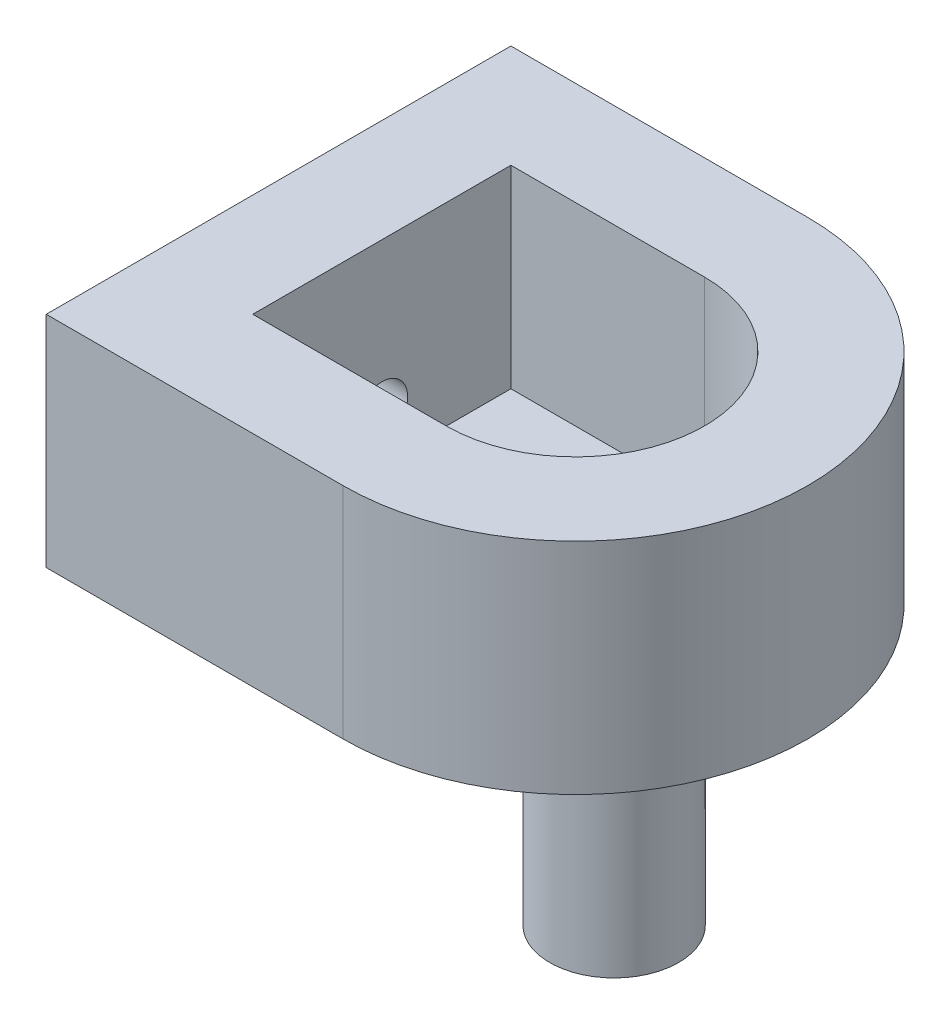
ISO-10303-21;
HEADER;
FILE_DESCRIPTION(('STEP AP214'),'2;1');
FILE_NAME('part.step','',(''),(''),'','','');
FILE_SCHEMA(('AUTOMOTIVE_DESIGN { 1 0 10303 214 1 1 1 1 }'));
ENDSEC;
DATA;
#1=APPLICATION_CONTEXT('core data for automotive mechanical design processes');
#2=APPLICATION_PROTOCOL_DEFINITION('international standard','automotive_design',2000,#1);
#3=PRODUCT_CONTEXT('',#1,'mechanical');
#4=PRODUCT('Part','Part','',(#3));
#5=PRODUCT_RELATED_PRODUCT_CATEGORY('part','',(#4));
#6=PRODUCT_DEFINITION_FORMATION('','',#4);
#7=PRODUCT_DEFINITION_CONTEXT('part definition',#1,'design');
#8=PRODUCT_DEFINITION('design','',#6,#7);
#9=PRODUCT_DEFINITION_SHAPE('','',#8);
#10=(LENGTH_UNIT() NAMED_UNIT(*) SI_UNIT(.MILLI.,.METRE.));
#11=(NAMED_UNIT(*) PLANE_ANGLE_UNIT() SI_UNIT($,.RADIAN.));
#12=(NAMED_UNIT(*) SI_UNIT($,.STERADIAN.) SOLID_ANGLE_UNIT());
#13=UNCERTAINTY_MEASURE_WITH_UNIT(LENGTH_MEASURE(1.E-05),#10,'distance_accuracy_value','');
#14=(GEOMETRIC_REPRESENTATION_CONTEXT(3) GLOBAL_UNCERTAINTY_ASSIGNED_CONTEXT((#13)) GLOBAL_UNIT_ASSIGNED_CONTEXT((#10,
#11,#12)) REPRESENTATION_CONTEXT('',''));
#15=CARTESIAN_POINT('',(0.,0.,0.));
#16=DIRECTION('',(0.,0.,1.));
#17=DIRECTION('',(1.,0.,0.));
#18=AXIS2_PLACEMENT_3D('',#15,#16,#17);
#19=CARTESIAN_POINT('',(0.,-2.,0.));
#20=DIRECTION('',(0.,-1.,0.));
#21=DIRECTION('',(0.,0.,-1.));
#22=AXIS2_PLACEMENT_3D('',#19,#20,#21);
#23=PLANE('',#22);
#24=CARTESIAN_POINT('',(3.,-2.,0.));
#25=DIRECTION('',(0.,-1.,0.));
#26=DIRECTION('',(0.,0.,-1.));
#27=AXIS2_PLACEMENT_3D('',#24,#25,#26);
#28=CIRCLE('',#27,3.);
#29=CARTESIAN_POINT('',(3.,-2.,-3.00000000000001));
#30=VERTEX_POINT('',#29);
#31=EDGE_CURVE('E49',#30,#30,#28,.F.);
#32=ORIENTED_EDGE('',*,*,#31,.T.);
#33=EDGE_LOOP('',(#32));
#34=FACE_BOUND('',#33,.T.);
#35=DIRECTION('',(1.,0.,0.));
#36=VECTOR('',#35,1.);
#37=CARTESIAN_POINT('',(-23.,-2.,-18.));
#38=LINE('',#37,#36);
#39=CARTESIAN_POINT('',(-23.,-2.,-18.));
#40=VERTEX_POINT('',#39);
#41=CARTESIAN_POINT('',(0.,-2.,-18.));
#42=VERTEX_POINT('',#41);
#43=EDGE_CURVE('E154',#40,#42,#38,.T.);
#44=ORIENTED_EDGE('',*,*,#43,.T.);
#45=CARTESIAN_POINT('',(0.,-2.,0.));
#46=DIRECTION('',(0.,-1.,0.));
#47=DIRECTION('',(0.,0.,-1.));
#48=AXIS2_PLACEMENT_3D('',#45,#46,#47);
#49=CIRCLE('',#48,18.);
#50=CARTESIAN_POINT('',(0.,-2.,18.));
#51=VERTEX_POINT('',#50);
#52=EDGE_CURVE('E152',#42,#51,#49,.T.);
#53=ORIENTED_EDGE('',*,*,#52,.T.);
#54=DIRECTION('',(1.,0.,0.));
#55=VECTOR('',#54,1.);
#56=CARTESIAN_POINT('',(-23.,-2.,18.));
#57=LINE('',#56,#55);
#58=CARTESIAN_POINT('',(-23.,-2.,18.));
#59=VERTEX_POINT('',#58);
#60=EDGE_CURVE('E149',#59,#51,#57,.T.);
#61=ORIENTED_EDGE('',*,*,#60,.F.);
#62=DIRECTION('',(0.,0.,1.));
#63=VECTOR('',#62,1.);
#64=CARTESIAN_POINT('',(-23.,-2.,-18.));
#65=LINE('',#64,#63);
#66=EDGE_CURVE('E146',#40,#59,#65,.T.);
#67=ORIENTED_EDGE('',*,*,#66,.F.);
#68=EDGE_LOOP('',(#44,#53,#61,#67));
#69=FACE_BOUND('',#68,.T.);
#70=ADVANCED_FACE('F45',(#34,#69),#23,.T.);
#71=CARTESIAN_POINT('',(-15.,15.,10.));
#72=DIRECTION('',(0.,0.,-1.));
#73=DIRECTION('',(-1.,0.,0.));
#74=AXIS2_PLACEMENT_3D('',#71,#72,#73);
#75=PLANE('',#74);
#76=DIRECTION('',(1.,0.,0.));
#77=VECTOR('',#76,1.);
#78=CARTESIAN_POINT('',(-15.,0.,10.));
#79=LINE('',#78,#77);
#80=CARTESIAN_POINT('',(-15.,0.,10.));
#81=VERTEX_POINT('',#80);
#82=CARTESIAN_POINT('',(0.,0.,10.));
#83=VERTEX_POINT('',#82);
#84=EDGE_CURVE('E120',#81,#83,#79,.T.);
#85=ORIENTED_EDGE('',*,*,#84,.F.);
#86=DIRECTION('',(0.,-1.,0.));
#87=VECTOR('',#86,1.);
#88=CARTESIAN_POINT('',(-15.,15.,10.));
#89=LINE('',#88,#87);
#90=CARTESIAN_POINT('',(-15.,15.,10.));
#91=VERTEX_POINT('',#90);
#92=EDGE_CURVE('E113',#91,#81,#89,.T.);
#93=ORIENTED_EDGE('',*,*,#92,.F.);
#94=DIRECTION('',(1.,0.,0.));
#95=VECTOR('',#94,1.);
#96=CARTESIAN_POINT('',(-15.,15.,10.));
#97=LINE('',#96,#95);
#98=CARTESIAN_POINT('',(0.,15.,10.));
#99=VERTEX_POINT('',#98);
#100=EDGE_CURVE('E117',#91,#99,#97,.T.);
#101=ORIENTED_EDGE('',*,*,#100,.T.);
#102=DIRECTION('',(0.,-1.,0.));
#103=VECTOR('',#102,1.);
#104=CARTESIAN_POINT('',(0.,15.,10.));
#105=LINE('',#104,#103);
#106=EDGE_CURVE('E124',#99,#83,#105,.T.);
#107=ORIENTED_EDGE('',*,*,#106,.T.);
#108=EDGE_LOOP('',(#85,#93,#101,#107));
#109=FACE_BOUND('',#108,.T.);
#110=ADVANCED_FACE('F115',(#109),#75,.T.);
#111=CARTESIAN_POINT('',(-15.,15.,-10.));
#112=DIRECTION('',(1.,0.,0.));
#113=DIRECTION('',(0.,0.,-1.));
#114=AXIS2_PLACEMENT_3D('',#111,#112,#113);
#115=PLANE('',#114);
#116=CARTESIAN_POINT('',(-15.,3.47,0.));
#117=DIRECTION('',(1.,0.,0.));
#118=DIRECTION('',(0.,0.,-1.));
#119=AXIS2_PLACEMENT_3D('',#116,#117,#118);
#120=CIRCLE('',#119,2.);
#121=CARTESIAN_POINT('',(-15.,3.47,-2.));
#122=VERTEX_POINT('',#121);
#123=EDGE_CURVE('E54',#122,#122,#120,.T.);
#124=ORIENTED_EDGE('',*,*,#123,.F.);
#125=EDGE_LOOP('',(#124));
#126=FACE_BOUND('',#125,.T.);
#127=DIRECTION('',(0.,0.,1.));
#128=VECTOR('',#127,1.);
#129=CARTESIAN_POINT('',(-15.,0.,-10.));
#130=LINE('',#129,#128);
#131=CARTESIAN_POINT('',(-15.,0.,-10.));
#132=VERTEX_POINT('',#131);
#133=EDGE_CURVE('E186',#132,#81,#130,.T.);
#134=ORIENTED_EDGE('',*,*,#133,.F.);
#135=DIRECTION('',(0.,-1.,0.));
#136=VECTOR('',#135,1.);
#137=CARTESIAN_POINT('',(-15.,15.,-10.));
#138=LINE('',#137,#136);
#139=CARTESIAN_POINT('',(-15.,15.,-10.));
#140=VERTEX_POINT('',#139);
#141=EDGE_CURVE('E125',#140,#132,#138,.T.);
#142=ORIENTED_EDGE('',*,*,#141,.F.);
#143=DIRECTION('',(0.,0.,1.));
#144=VECTOR('',#143,1.);
#145=CARTESIAN_POINT('',(-15.,15.,-10.));
#146=LINE('',#145,#144);
#147=EDGE_CURVE('E129',#140,#91,#146,.T.);
#148=ORIENTED_EDGE('',*,*,#147,.T.);
#149=ORIENTED_EDGE('',*,*,#92,.T.);
#150=EDGE_LOOP('',(#134,#142,#148,#149));
#151=FACE_BOUND('',#150,.T.);
#152=ADVANCED_FACE('F130',(#126,#151),#115,.T.);
#153=CARTESIAN_POINT('',(-15.,15.,-10.));
#154=DIRECTION('',(0.,0.,1.));
#155=DIRECTION('',(1.,0.,0.));
#156=AXIS2_PLACEMENT_3D('',#153,#154,#155);
#157=PLANE('',#156);
#158=DIRECTION('',(-1.,0.,0.));
#159=VECTOR('',#158,1.);
#160=CARTESIAN_POINT('',(-15.,0.,-10.));
#161=LINE('',#160,#159);
#162=CARTESIAN_POINT('',(0.,0.,-10.));
#163=VERTEX_POINT('',#162);
#164=EDGE_CURVE('E187',#163,#132,#161,.T.);
#165=ORIENTED_EDGE('',*,*,#164,.F.);
#166=DIRECTION('',(0.,-1.,0.));
#167=VECTOR('',#166,1.);
#168=CARTESIAN_POINT('',(0.,15.,-10.));
#169=LINE('',#168,#167);
#170=CARTESIAN_POINT('',(0.,15.,-10.));
#171=VERTEX_POINT('',#170);
#172=EDGE_CURVE('E181',#171,#163,#169,.T.);
#173=ORIENTED_EDGE('',*,*,#172,.F.);
#174=DIRECTION('',(-1.,0.,0.));
#175=VECTOR('',#174,1.);
#176=CARTESIAN_POINT('',(-15.,15.,-10.));
#177=LINE('',#176,#175);
#178=EDGE_CURVE('E133',#171,#140,#177,.T.);
#179=ORIENTED_EDGE('',*,*,#178,.T.);
#180=ORIENTED_EDGE('',*,*,#141,.T.);
#181=EDGE_LOOP('',(#165,#173,#179,#180));
#182=FACE_BOUND('',#181,.T.);
#183=ADVANCED_FACE('F197',(#182),#157,.T.);
#184=CARTESIAN_POINT('',(0.,15.,0.));
#185=DIRECTION('',(0.,-1.,0.));
#186=DIRECTION('',(0.,0.,-1.));
#187=AXIS2_PLACEMENT_3D('',#184,#185,#186);
#188=CYLINDRICAL_SURFACE('',#187,10.);
#189=CARTESIAN_POINT('',(0.,0.,0.));
#190=DIRECTION('',(0.,1.,0.));
#191=DIRECTION('',(0.,0.,-1.));
#192=AXIS2_PLACEMENT_3D('',#189,#190,#191);
#193=CIRCLE('',#192,10.);
#194=EDGE_CURVE('E141',#83,#163,#193,.T.);
#195=ORIENTED_EDGE('',*,*,#194,.F.);
#196=ORIENTED_EDGE('',*,*,#106,.F.);
#197=CARTESIAN_POINT('',(0.,15.,0.));
#198=DIRECTION('',(0.,1.,0.));
#199=DIRECTION('',(0.,0.,-1.));
#200=AXIS2_PLACEMENT_3D('',#197,#198,#199);
#201=CIRCLE('',#200,10.);
#202=EDGE_CURVE('E137',#99,#171,#201,.T.);
#203=ORIENTED_EDGE('',*,*,#202,.T.);
#204=ORIENTED_EDGE('',*,*,#172,.T.);
#205=EDGE_LOOP('',(#195,#196,#203,#204));
#206=FACE_BOUND('',#205,.T.);
#207=ADVANCED_FACE('F194',(#206),#188,.F.);
#208=CARTESIAN_POINT('',(0.,0.,0.));
#209=DIRECTION('',(0.,-1.,0.));
#210=DIRECTION('',(0.,0.,-1.));
#211=AXIS2_PLACEMENT_3D('',#208,#209,#210);
#212=PLANE('',#211);
#213=CARTESIAN_POINT('',(3.,0.,0.));
#214=DIRECTION('',(0.,-1.,0.));
#215=DIRECTION('',(0.,0.,-1.));
#216=AXIS2_PLACEMENT_3D('',#213,#214,#215);
#217=CIRCLE('',#216,3.);
#218=CARTESIAN_POINT('',(3.,0.,-3.00000000000001));
#219=VERTEX_POINT('',#218);
#220=EDGE_CURVE('E156',#219,#219,#217,.T.);
#221=ORIENTED_EDGE('',*,*,#220,.T.);
#222=EDGE_LOOP('',(#221));
#223=FACE_BOUND('',#222,.T.);
#224=ORIENTED_EDGE('',*,*,#194,.T.);
#225=ORIENTED_EDGE('',*,*,#164,.T.);
#226=ORIENTED_EDGE('',*,*,#133,.T.);
#227=ORIENTED_EDGE('',*,*,#84,.T.);
#228=EDGE_LOOP('',(#224,#225,#226,#227));
#229=FACE_BOUND('',#228,.T.);
#230=ADVANCED_FACE('F192',(#223,#229),#212,.F.);
#231=CARTESIAN_POINT('',(3.,15.,0.));
#232=DIRECTION('',(0.,-1.,0.));
#233=DIRECTION('',(0.,0.,-1.));
#234=AXIS2_PLACEMENT_3D('',#231,#232,#233);
#235=CYLINDRICAL_SURFACE('',#234,3.);
#236=ORIENTED_EDGE('',*,*,#220,.F.);
#237=EDGE_LOOP('',(#236));
#238=FACE_BOUND('',#237,.T.);
#239=ORIENTED_EDGE('',*,*,#31,.F.);
#240=EDGE_LOOP('',(#239));
#241=FACE_BOUND('',#240,.T.);
#242=ADVANCED_FACE('F47',(#238,#241),#235,.F.);
#243=CARTESIAN_POINT('',(0.,15.,0.));
#244=DIRECTION('',(0.,-1.,0.));
#245=DIRECTION('',(0.,0.,-1.));
#246=AXIS2_PLACEMENT_3D('',#243,#244,#245);
#247=CYLINDRICAL_SURFACE('',#246,18.);
#248=DIRECTION('',(0.,-1.,0.));
#249=VECTOR('',#248,1.);
#250=CARTESIAN_POINT('',(0.,15.,18.));
#251=LINE('',#250,#249);
#252=CARTESIAN_POINT('',(0.,15.,18.));
#253=VERTEX_POINT('',#252);
#254=EDGE_CURVE('E68',#253,#51,#251,.T.);
#255=ORIENTED_EDGE('',*,*,#254,.T.);
#256=ORIENTED_EDGE('',*,*,#52,.F.);
#257=DIRECTION('',(0.,-1.,0.));
#258=VECTOR('',#257,1.);
#259=CARTESIAN_POINT('',(0.,15.,-18.));
#260=LINE('',#259,#258);
#261=CARTESIAN_POINT('',(0.,15.,-18.));
#262=VERTEX_POINT('',#261);
#263=EDGE_CURVE('E61',#262,#42,#260,.T.);
#264=ORIENTED_EDGE('',*,*,#263,.F.);
#265=CARTESIAN_POINT('',(0.,15.,0.));
#266=DIRECTION('',(0.,1.,0.));
#267=DIRECTION('',(0.,0.,-1.));
#268=AXIS2_PLACEMENT_3D('',#265,#266,#267);
#269=CIRCLE('',#268,18.);
#270=EDGE_CURVE('E174',#253,#262,#269,.T.);
#271=ORIENTED_EDGE('',*,*,#270,.F.);
#272=EDGE_LOOP('',(#255,#256,#264,#271));
#273=FACE_BOUND('',#272,.T.);
#274=ADVANCED_FACE('F239',(#273),#247,.T.);
#275=CARTESIAN_POINT('',(0.,15.,0.));
#276=DIRECTION('',(0.,-1.,0.));
#277=DIRECTION('',(0.,0.,-1.));
#278=AXIS2_PLACEMENT_3D('',#275,#276,#277);
#279=PLANE('',#278);
#280=DIRECTION('',(0.,0.,1.));
#281=VECTOR('',#280,1.);
#282=CARTESIAN_POINT('',(-23.,15.,-18.));
#283=LINE('',#282,#281);
#284=CARTESIAN_POINT('',(-23.,15.,-18.));
#285=VERTEX_POINT('',#284);
#286=CARTESIAN_POINT('',(-23.,15.,18.));
#287=VERTEX_POINT('',#286);
#288=EDGE_CURVE('E178',#285,#287,#283,.T.);
#289=ORIENTED_EDGE('',*,*,#288,.T.);
#290=DIRECTION('',(1.,0.,0.));
#291=VECTOR('',#290,1.);
#292=CARTESIAN_POINT('',(-23.,15.,18.));
#293=LINE('',#292,#291);
#294=EDGE_CURVE('E176',#287,#253,#293,.T.);
#295=ORIENTED_EDGE('',*,*,#294,.T.);
#296=ORIENTED_EDGE('',*,*,#270,.T.);
#297=DIRECTION('',(-1.,0.,0.));
#298=VECTOR('',#297,1.);
#299=CARTESIAN_POINT('',(-23.,15.,-18.));
#300=LINE('',#299,#298);
#301=EDGE_CURVE('E172',#262,#285,#300,.T.);
#302=ORIENTED_EDGE('',*,*,#301,.T.);
#303=EDGE_LOOP('',(#289,#295,#296,#302));
#304=FACE_BOUND('',#303,.T.);
#305=ORIENTED_EDGE('',*,*,#202,.F.);
#306=ORIENTED_EDGE('',*,*,#100,.F.);
#307=ORIENTED_EDGE('',*,*,#147,.F.);
#308=ORIENTED_EDGE('',*,*,#178,.F.);
#309=EDGE_LOOP('',(#305,#306,#307,#308));
#310=FACE_BOUND('',#309,.T.);
#311=ADVANCED_FACE('F136',(#304,#310),#279,.F.);
#312=CARTESIAN_POINT('',(-23.,15.,18.));
#313=DIRECTION('',(0.,0.,-1.));
#314=DIRECTION('',(-1.,0.,0.));
#315=AXIS2_PLACEMENT_3D('',#312,#313,#314);
#316=PLANE('',#315);
#317=DIRECTION('',(0.,-1.,0.));
#318=VECTOR('',#317,1.);
#319=CARTESIAN_POINT('',(-23.,15.,18.));
#320=LINE('',#319,#318);
#321=EDGE_CURVE('E166',#287,#59,#320,.T.);
#322=ORIENTED_EDGE('',*,*,#321,.T.);
#323=ORIENTED_EDGE('',*,*,#60,.T.);
#324=ORIENTED_EDGE('',*,*,#254,.F.);
#325=ORIENTED_EDGE('',*,*,#294,.F.);
#326=EDGE_LOOP('',(#322,#323,#324,#325));
#327=FACE_BOUND('',#326,.T.);
#328=ADVANCED_FACE('F227',(#327),#316,.F.);
#329=CARTESIAN_POINT('',(-23.,15.,-18.));
#330=DIRECTION('',(0.,0.,1.));
#331=DIRECTION('',(1.,0.,0.));
#332=AXIS2_PLACEMENT_3D('',#329,#330,#331);
#333=PLANE('',#332);
#334=ORIENTED_EDGE('',*,*,#263,.T.);
#335=ORIENTED_EDGE('',*,*,#43,.F.);
#336=DIRECTION('',(0.,-1.,0.));
#337=VECTOR('',#336,1.);
#338=CARTESIAN_POINT('',(-23.,15.,-18.));
#339=LINE('',#338,#337);
#340=EDGE_CURVE('E170',#285,#40,#339,.T.);
#341=ORIENTED_EDGE('',*,*,#340,.F.);
#342=ORIENTED_EDGE('',*,*,#301,.F.);
#343=EDGE_LOOP('',(#334,#335,#341,#342));
#344=FACE_BOUND('',#343,.T.);
#345=ADVANCED_FACE('F219',(#344),#333,.F.);
#346=CARTESIAN_POINT('',(-3.,3.47,0.));
#347=DIRECTION('',(-1.,0.,0.));
#348=DIRECTION('',(0.,0.,1.));
#349=AXIS2_PLACEMENT_3D('',#346,#347,#348);
#350=CYLINDRICAL_SURFACE('',#349,2.);
#351=ORIENTED_EDGE('',*,*,#123,.T.);
#352=EDGE_LOOP('',(#351));
#353=FACE_BOUND('',#352,.T.);
#354=CARTESIAN_POINT('',(-23.,3.47,0.));
#355=DIRECTION('',(-1.,0.,0.));
#356=DIRECTION('',(0.,0.,1.));
#357=AXIS2_PLACEMENT_3D('',#354,#355,#356);
#358=CIRCLE('',#357,2.);
#359=CARTESIAN_POINT('',(-23.,3.47,2.));
#360=VERTEX_POINT('',#359);
#361=EDGE_CURVE('E13',#360,#360,#358,.T.);
#362=ORIENTED_EDGE('',*,*,#361,.T.);
#363=EDGE_LOOP('',(#362));
#364=FACE_BOUND('',#363,.T.);
#365=ADVANCED_FACE('F217',(#353,#364),#350,.F.);
#366=CARTESIAN_POINT('',(-23.,15.,-18.));
#367=DIRECTION('',(1.,0.,0.));
#368=DIRECTION('',(0.,0.,-1.));
#369=AXIS2_PLACEMENT_3D('',#366,#367,#368);
#370=PLANE('',#369);
#371=ORIENTED_EDGE('',*,*,#361,.F.);
#372=EDGE_LOOP('',(#371));
#373=FACE_BOUND('',#372,.T.);
#374=ORIENTED_EDGE('',*,*,#340,.T.);
#375=ORIENTED_EDGE('',*,*,#66,.T.);
#376=ORIENTED_EDGE('',*,*,#321,.F.);
#377=ORIENTED_EDGE('',*,*,#288,.F.);
#378=EDGE_LOOP('',(#374,#375,#376,#377));
#379=FACE_BOUND('',#378,.T.);
#380=ADVANCED_FACE('F213',(#373,#379),#370,.F.);
#381=CLOSED_SHELL('',(#70,#110,#152,#183,#207,#230,#242,#274,#311,#328,#345,#365,#380));
#382=MANIFOLD_SOLID_BREP('B2',#381);
#383=CARTESIAN_POINT('',(0.,-2.,0.));
#384=DIRECTION('',(0.,-1.,0.));
#385=DIRECTION('',(0.,0.,-1.));
#386=AXIS2_PLACEMENT_3D('',#383,#384,#385);
#387=PLANE('',#386);
#388=CARTESIAN_POINT('',(3.,-2.,0.));
#389=DIRECTION('',(0.,-1.,0.));
#390=DIRECTION('',(0.,0.,-1.));
#391=AXIS2_PLACEMENT_3D('',#388,#389,#390);
#392=CIRCLE('',#391,3.);
#393=CARTESIAN_POINT('',(3.,-2.,-3.00000000000001));
#394=VERTEX_POINT('',#393);
#395=EDGE_CURVE('E44',#394,#394,#392,.F.);
#396=ORIENTED_EDGE('',*,*,#395,.F.);
#397=EDGE_LOOP('',(#396));
#398=FACE_BOUND('',#397,.T.);
#399=CARTESIAN_POINT('',(3.,-2.,0.));
#400=DIRECTION('',(0.,-1.,0.));
#401=DIRECTION('',(0.,0.,-1.));
#402=AXIS2_PLACEMENT_3D('',#399,#400,#401);
#403=CIRCLE('',#402,5.);
#404=CARTESIAN_POINT('',(3.,-2.,-5.00000000000001));
#405=VERTEX_POINT('',#404);
#406=EDGE_CURVE('E352',#405,#405,#403,.T.);
#407=ORIENTED_EDGE('',*,*,#406,.F.);
#408=EDGE_LOOP('',(#407));
#409=FACE_BOUND('',#408,.T.);
#410=ADVANCED_FACE('F342',(#398,#409),#387,.F.);
#411=CARTESIAN_POINT('',(0.,-20.,0.));
#412=DIRECTION('',(0.,-1.,0.));
#413=DIRECTION('',(0.,0.,-1.));
#414=AXIS2_PLACEMENT_3D('',#411,#412,#413);
#415=PLANE('',#414);
#416=CARTESIAN_POINT('',(3.,-20.,0.));
#417=DIRECTION('',(0.,-1.,0.));
#418=DIRECTION('',(0.,0.,-1.));
#419=AXIS2_PLACEMENT_3D('',#416,#417,#418);
#420=CIRCLE('',#419,3.);
#421=CARTESIAN_POINT('',(3.,-20.,-3.00000000000001));
#422=VERTEX_POINT('',#421);
#423=EDGE_CURVE('E357',#422,#422,#420,.T.);
#424=ORIENTED_EDGE('',*,*,#423,.F.);
#425=EDGE_LOOP('',(#424));
#426=FACE_BOUND('',#425,.T.);
#427=ADVANCED_FACE('F364',(#426),#415,.F.);
#428=CARTESIAN_POINT('',(3.,15.,0.));
#429=DIRECTION('',(0.,-1.,0.));
#430=DIRECTION('',(0.,0.,-1.));
#431=AXIS2_PLACEMENT_3D('',#428,#429,#430);
#432=CYLINDRICAL_SURFACE('',#431,3.);
#433=ORIENTED_EDGE('',*,*,#395,.T.);
#434=EDGE_LOOP('',(#433));
#435=FACE_BOUND('',#434,.T.);
#436=ORIENTED_EDGE('',*,*,#423,.T.);
#437=EDGE_LOOP('',(#436));
#438=FACE_BOUND('',#437,.T.);
#439=ADVANCED_FACE('F362',(#435,#438),#432,.F.);
#440=CARTESIAN_POINT('',(0.,-22.,0.));
#441=DIRECTION('',(0.,-1.,0.));
#442=DIRECTION('',(0.,0.,-1.));
#443=AXIS2_PLACEMENT_3D('',#440,#441,#442);
#444=PLANE('',#443);
#445=CARTESIAN_POINT('',(3.,-22.,0.));
#446=DIRECTION('',(0.,-1.,0.));
#447=DIRECTION('',(0.,0.,-1.));
#448=AXIS2_PLACEMENT_3D('',#445,#446,#447);
#449=CIRCLE('',#448,5.);
#450=CARTESIAN_POINT('',(3.,-22.,-5.00000000000001));
#451=VERTEX_POINT('',#450);
#452=EDGE_CURVE('E348',#451,#451,#449,.T.);
#453=ORIENTED_EDGE('',*,*,#452,.T.);
#454=EDGE_LOOP('',(#453));
#455=FACE_BOUND('',#454,.T.);
#456=ADVANCED_FACE('F371',(#455),#444,.T.);
#457=CARTESIAN_POINT('',(3.,-22.,0.));
#458=DIRECTION('',(0.,1.,0.));
#459=DIRECTION('',(0.,0.,1.));
#460=AXIS2_PLACEMENT_3D('',#457,#458,#459);
#461=CYLINDRICAL_SURFACE('',#460,5.);
#462=ORIENTED_EDGE('',*,*,#452,.F.);
#463=EDGE_LOOP('',(#462));
#464=FACE_BOUND('',#463,.T.);
#465=ORIENTED_EDGE('',*,*,#406,.T.);
#466=EDGE_LOOP('',(#465));
#467=FACE_BOUND('',#466,.T.);
#468=ADVANCED_FACE('F374',(#464,#467),#461,.T.);
#469=CLOSED_SHELL('',(#410,#427,#439,#456,#468));
#470=MANIFOLD_SOLID_BREP('B7',#469);
#471=ADVANCED_BREP_SHAPE_REPRESENTATION('',(#18,#382,#470),#14);
#472=SHAPE_DEFINITION_REPRESENTATION(#9,#471);
ENDSEC;
END-ISO-10303-21;
